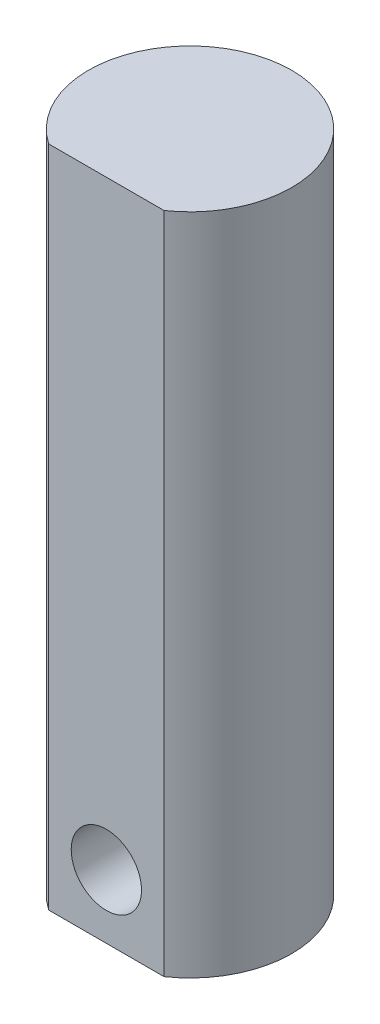
ISO-10303-21;
HEADER;
FILE_DESCRIPTION(('STEP AP214'),'2;1');
FILE_NAME('part.step','',(''),(''),'','','');
FILE_SCHEMA(('AUTOMOTIVE_DESIGN { 1 0 10303 214 1 1 1 1 }'));
ENDSEC;
DATA;
#1=APPLICATION_CONTEXT('core data for automotive mechanical design processes');
#2=APPLICATION_PROTOCOL_DEFINITION('international standard','automotive_design',2000,#1);
#3=PRODUCT_CONTEXT('',#1,'mechanical');
#4=PRODUCT('Part','Part','',(#3));
#5=PRODUCT_RELATED_PRODUCT_CATEGORY('part','',(#4));
#6=PRODUCT_DEFINITION_FORMATION('','',#4);
#7=PRODUCT_DEFINITION_CONTEXT('part definition',#1,'design');
#8=PRODUCT_DEFINITION('design','',#6,#7);
#9=PRODUCT_DEFINITION_SHAPE('','',#8);
#10=(LENGTH_UNIT() NAMED_UNIT(*) SI_UNIT(.MILLI.,.METRE.));
#11=(NAMED_UNIT(*) PLANE_ANGLE_UNIT() SI_UNIT($,.RADIAN.));
#12=(NAMED_UNIT(*) SI_UNIT($,.STERADIAN.) SOLID_ANGLE_UNIT());
#13=UNCERTAINTY_MEASURE_WITH_UNIT(LENGTH_MEASURE(1.E-05),#10,'distance_accuracy_value','');
#14=(GEOMETRIC_REPRESENTATION_CONTEXT(3) GLOBAL_UNCERTAINTY_ASSIGNED_CONTEXT((#13)) GLOBAL_UNIT_ASSIGNED_CONTEXT((#10,
#11,#12)) REPRESENTATION_CONTEXT('',''));
#15=CARTESIAN_POINT('',(0.,0.,0.));
#16=DIRECTION('',(0.,0.,1.));
#17=DIRECTION('',(1.,0.,0.));
#18=AXIS2_PLACEMENT_3D('',#15,#16,#17);
#19=CARTESIAN_POINT('',(0.,23.585,0.));
#20=DIRECTION('',(0.,-1.,0.));
#21=DIRECTION('',(0.,0.,-1.));
#22=AXIS2_PLACEMENT_3D('',#19,#20,#21);
#23=CYLINDRICAL_SURFACE('',#22,7.225);
#24=CARTESIAN_POINT('',(0.,-23.585,0.));
#25=DIRECTION('',(0.,-1.,0.));
#26=DIRECTION('',(0.,0.,-1.));
#27=AXIS2_PLACEMENT_3D('',#24,#25,#26);
#28=CIRCLE('',#27,7.225);
#29=CARTESIAN_POINT('',(-4.1,-23.585,5.9490020171454));
#30=VERTEX_POINT('',#29);
#31=CARTESIAN_POINT('',(4.1,-23.585,5.9490020171454));
#32=VERTEX_POINT('',#31);
#33=EDGE_CURVE('E68',#30,#32,#28,.T.);
#34=ORIENTED_EDGE('',*,*,#33,.F.);
#35=DIRECTION('',(0.,-1.,0.));
#36=VECTOR('',#35,1.);
#37=CARTESIAN_POINT('',(-4.1,23.585,5.9490020171454));
#38=LINE('',#37,#36);
#39=CARTESIAN_POINT('',(-4.1,23.585,5.9490020171454));
#40=VERTEX_POINT('',#39);
#41=EDGE_CURVE('E12',#40,#30,#38,.T.);
#42=ORIENTED_EDGE('',*,*,#41,.F.);
#43=CARTESIAN_POINT('',(0.,23.585,0.));
#44=DIRECTION('',(0.,-1.,0.));
#45=DIRECTION('',(0.,0.,-1.));
#46=AXIS2_PLACEMENT_3D('',#43,#44,#45);
#47=CIRCLE('',#46,7.225);
#48=CARTESIAN_POINT('',(4.1,23.585,5.9490020171454));
#49=VERTEX_POINT('',#48);
#50=EDGE_CURVE('E69',#40,#49,#47,.T.);
#51=ORIENTED_EDGE('',*,*,#50,.T.);
#52=DIRECTION('',(0.,-1.,0.));
#53=VECTOR('',#52,1.);
#54=CARTESIAN_POINT('',(4.1,23.585,5.9490020171454));
#55=LINE('',#54,#53);
#56=EDGE_CURVE('E40',#49,#32,#55,.T.);
#57=ORIENTED_EDGE('',*,*,#56,.T.);
#58=EDGE_LOOP('',(#34,#42,#51,#57));
#59=FACE_BOUND('',#58,.T.);
#60=ADVANCED_FACE('F37',(#59),#23,.T.);
#61=CARTESIAN_POINT('',(-4.1,23.585,5.9490020171454));
#62=DIRECTION('',(0.,0.,-1.));
#63=DIRECTION('',(-1.,0.,0.));
#64=AXIS2_PLACEMENT_3D('',#61,#62,#63);
#65=PLANE('',#64);
#66=CARTESIAN_POINT('',(1.98475814555463E-13,-19.06,5.9490020171454));
#67=DIRECTION('',(0.,0.,-1.));
#68=DIRECTION('',(-1.,0.,0.));
#69=AXIS2_PLACEMENT_3D('',#66,#67,#68);
#70=CIRCLE('',#69,2.5);
#71=CARTESIAN_POINT('',(-2.4999999999998,-19.06,5.9490020171454));
#72=VERTEX_POINT('',#71);
#73=EDGE_CURVE('E74',#72,#72,#70,.T.);
#74=ORIENTED_EDGE('',*,*,#73,.T.);
#75=EDGE_LOOP('',(#74));
#76=FACE_BOUND('',#75,.T.);
#77=DIRECTION('',(1.,0.,0.));
#78=VECTOR('',#77,1.);
#79=CARTESIAN_POINT('',(-4.1,-23.585,5.9490020171454));
#80=LINE('',#79,#78);
#81=EDGE_CURVE('E62',#30,#32,#80,.T.);
#82=ORIENTED_EDGE('',*,*,#81,.T.);
#83=ORIENTED_EDGE('',*,*,#56,.F.);
#84=DIRECTION('',(1.,0.,0.));
#85=VECTOR('',#84,1.);
#86=CARTESIAN_POINT('',(-4.1,23.585,5.9490020171454));
#87=LINE('',#86,#85);
#88=EDGE_CURVE('E64',#40,#49,#87,.T.);
#89=ORIENTED_EDGE('',*,*,#88,.F.);
#90=ORIENTED_EDGE('',*,*,#41,.T.);
#91=EDGE_LOOP('',(#82,#83,#89,#90));
#92=FACE_BOUND('',#91,.T.);
#93=ADVANCED_FACE('F61',(#76,#92),#65,.F.);
#94=CARTESIAN_POINT('',(0.,23.585,0.));
#95=DIRECTION('',(0.,-1.,0.));
#96=DIRECTION('',(0.,0.,-1.));
#97=AXIS2_PLACEMENT_3D('',#94,#95,#96);
#98=PLANE('',#97);
#99=ORIENTED_EDGE('',*,*,#50,.F.);
#100=ORIENTED_EDGE('',*,*,#88,.T.);
#101=EDGE_LOOP('',(#99,#100));
#102=FACE_BOUND('',#101,.T.);
#103=ADVANCED_FACE('F94',(#102),#98,.F.);
#104=CARTESIAN_POINT('',(0.,-23.585,0.));
#105=DIRECTION('',(0.,-1.,0.));
#106=DIRECTION('',(0.,0.,-1.));
#107=AXIS2_PLACEMENT_3D('',#104,#105,#106);
#108=PLANE('',#107);
#109=ORIENTED_EDGE('',*,*,#33,.T.);
#110=ORIENTED_EDGE('',*,*,#81,.F.);
#111=EDGE_LOOP('',(#109,#110));
#112=FACE_BOUND('',#111,.T.);
#113=ADVANCED_FACE('F67',(#112),#108,.T.);
#114=CARTESIAN_POINT('',(1.98475814555463E-13,-19.06,2.1990020171454));
#115=DIRECTION('',(0.,0.,1.));
#116=DIRECTION('',(1.,0.,0.));
#117=AXIS2_PLACEMENT_3D('',#114,#115,#116);
#118=CYLINDRICAL_SURFACE('',#117,2.5);
#119=CARTESIAN_POINT('',(1.98475814555463E-13,-19.06,2.1990020171454));
#120=DIRECTION('',(0.,0.,-1.));
#121=DIRECTION('',(-1.,0.,0.));
#122=AXIS2_PLACEMENT_3D('',#119,#120,#121);
#123=CIRCLE('',#122,2.5);
#124=CARTESIAN_POINT('',(-2.4999999999998,-19.06,2.1990020171454));
#125=VERTEX_POINT('',#124);
#126=EDGE_CURVE('E71',#125,#125,#123,.T.);
#127=ORIENTED_EDGE('',*,*,#126,.T.);
#128=EDGE_LOOP('',(#127));
#129=FACE_BOUND('',#128,.T.);
#130=ORIENTED_EDGE('',*,*,#73,.F.);
#131=EDGE_LOOP('',(#130));
#132=FACE_BOUND('',#131,.T.);
#133=ADVANCED_FACE('F83',(#129,#132),#118,.F.);
#134=CARTESIAN_POINT('',(1.98475814555463E-13,-19.06,2.1990020171454));
#135=DIRECTION('',(0.,0.,-1.));
#136=DIRECTION('',(-1.,0.,0.));
#137=AXIS2_PLACEMENT_3D('',#134,#135,#136);
#138=PLANE('',#137);
#139=ORIENTED_EDGE('',*,*,#126,.F.);
#140=EDGE_LOOP('',(#139));
#141=FACE_BOUND('',#140,.T.);
#142=ADVANCED_FACE('F85',(#141),#138,.F.);
#143=CLOSED_SHELL('',(#60,#93,#103,#113,#133,#142));
#144=MANIFOLD_SOLID_BREP('B2',#143);
#145=ADVANCED_BREP_SHAPE_REPRESENTATION('',(#18,#144),#14);
#146=SHAPE_DEFINITION_REPRESENTATION(#9,#145);
ENDSEC;
END-ISO-10303-21;
